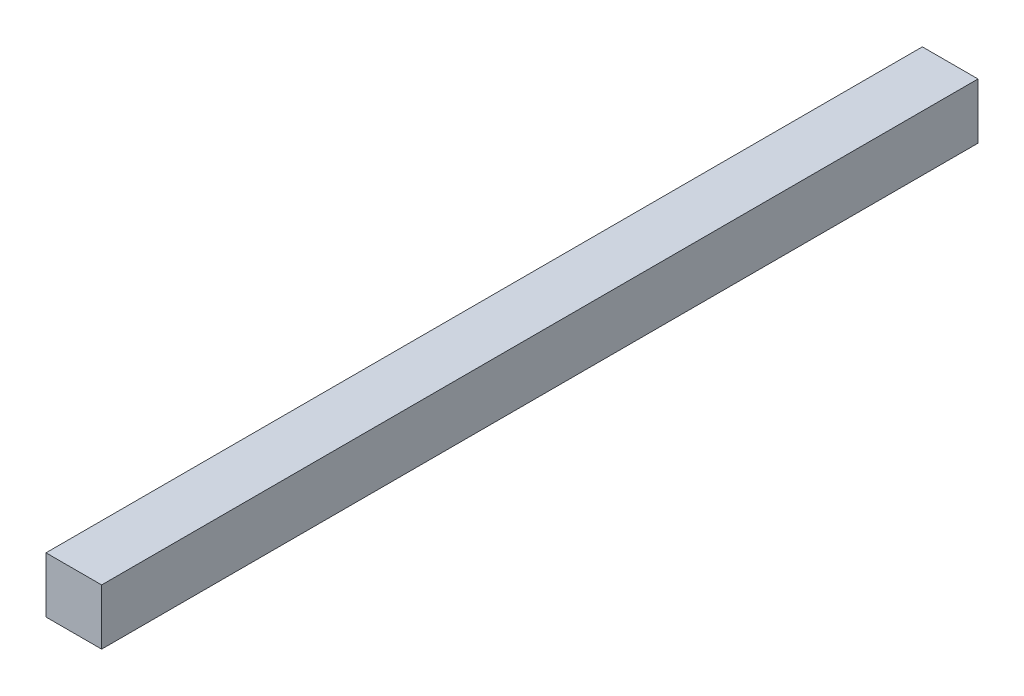
ISO-10303-21;
HEADER;
FILE_DESCRIPTION(('STEP AP214'),'2;1');
FILE_NAME('part.step','',(''),(''),'','','');
FILE_SCHEMA(('AUTOMOTIVE_DESIGN { 1 0 10303 214 1 1 1 1 }'));
ENDSEC;
DATA;
#1=APPLICATION_CONTEXT('core data for automotive mechanical design processes');
#2=APPLICATION_PROTOCOL_DEFINITION('international standard','automotive_design',2000,#1);
#3=PRODUCT_CONTEXT('',#1,'mechanical');
#4=PRODUCT('Part','Part','',(#3));
#5=PRODUCT_RELATED_PRODUCT_CATEGORY('part','',(#4));
#6=PRODUCT_DEFINITION_FORMATION('','',#4);
#7=PRODUCT_DEFINITION_CONTEXT('part definition',#1,'design');
#8=PRODUCT_DEFINITION('design','',#6,#7);
#9=PRODUCT_DEFINITION_SHAPE('','',#8);
#10=(LENGTH_UNIT() NAMED_UNIT(*) SI_UNIT(.MILLI.,.METRE.));
#11=(NAMED_UNIT(*) PLANE_ANGLE_UNIT() SI_UNIT($,.RADIAN.));
#12=(NAMED_UNIT(*) SI_UNIT($,.STERADIAN.) SOLID_ANGLE_UNIT());
#13=UNCERTAINTY_MEASURE_WITH_UNIT(LENGTH_MEASURE(1.E-05),#10,'distance_accuracy_value','');
#14=(GEOMETRIC_REPRESENTATION_CONTEXT(3) GLOBAL_UNCERTAINTY_ASSIGNED_CONTEXT((#13)) GLOBAL_UNIT_ASSIGNED_CONTEXT((#10,
#11,#12)) REPRESENTATION_CONTEXT('',''));
#15=CARTESIAN_POINT('',(0.,0.,0.));
#16=DIRECTION('',(0.,0.,1.));
#17=DIRECTION('',(1.,0.,0.));
#18=AXIS2_PLACEMENT_3D('',#15,#16,#17);
#19=CARTESIAN_POINT('',(0.,0.,-315.));
#20=DIRECTION('',(-1.,0.,0.));
#21=DIRECTION('',(0.,-1.,0.));
#22=AXIS2_PLACEMENT_3D('',#19,#20,#21);
#23=PLANE('',#22);
#24=DIRECTION('',(0.,-1.,0.));
#25=VECTOR('',#24,1.);
#26=CARTESIAN_POINT('',(0.,0.,0.));
#27=LINE('',#26,#25);
#28=CARTESIAN_POINT('',(0.,20.,0.));
#29=VERTEX_POINT('',#28);
#30=CARTESIAN_POINT('',(0.,0.,0.));
#31=VERTEX_POINT('',#30);
#32=EDGE_CURVE('E97',#29,#31,#27,.T.);
#33=ORIENTED_EDGE('',*,*,#32,.F.);
#34=DIRECTION('',(0.,0.,1.));
#35=VECTOR('',#34,1.);
#36=CARTESIAN_POINT('',(0.,20.,-315.));
#37=LINE('',#36,#35);
#38=CARTESIAN_POINT('',(0.,20.,-315.));
#39=VERTEX_POINT('',#38);
#40=EDGE_CURVE('E11',#39,#29,#37,.T.);
#41=ORIENTED_EDGE('',*,*,#40,.F.);
#42=DIRECTION('',(0.,-1.,0.));
#43=VECTOR('',#42,1.);
#44=CARTESIAN_POINT('',(0.,0.,-315.));
#45=LINE('',#44,#43);
#46=CARTESIAN_POINT('',(0.,0.,-315.));
#47=VERTEX_POINT('',#46);
#48=EDGE_CURVE('E91',#39,#47,#45,.T.);
#49=ORIENTED_EDGE('',*,*,#48,.T.);
#50=DIRECTION('',(0.,0.,1.));
#51=VECTOR('',#50,1.);
#52=CARTESIAN_POINT('',(0.,0.,-315.));
#53=LINE('',#52,#51);
#54=EDGE_CURVE('E36',#47,#31,#53,.T.);
#55=ORIENTED_EDGE('',*,*,#54,.T.);
#56=EDGE_LOOP('',(#33,#41,#49,#55));
#57=FACE_BOUND('',#56,.T.);
#58=ADVANCED_FACE('F33',(#57),#23,.T.);
#59=CARTESIAN_POINT('',(0.,20.,-315.));
#60=DIRECTION('',(0.,1.,0.));
#61=DIRECTION('',(0.,0.,1.));
#62=AXIS2_PLACEMENT_3D('',#59,#60,#61);
#63=PLANE('',#62);
#64=DIRECTION('',(-1.,0.,0.));
#65=VECTOR('',#64,1.);
#66=CARTESIAN_POINT('',(0.,20.,0.));
#67=LINE('',#66,#65);
#68=CARTESIAN_POINT('',(20.,20.,0.));
#69=VERTEX_POINT('',#68);
#70=EDGE_CURVE('E93',#69,#29,#67,.T.);
#71=ORIENTED_EDGE('',*,*,#70,.F.);
#72=DIRECTION('',(0.,0.,1.));
#73=VECTOR('',#72,1.);
#74=CARTESIAN_POINT('',(20.,20.,-315.));
#75=LINE('',#74,#73);
#76=CARTESIAN_POINT('',(20.,20.,-315.));
#77=VERTEX_POINT('',#76);
#78=EDGE_CURVE('E42',#77,#69,#75,.T.);
#79=ORIENTED_EDGE('',*,*,#78,.F.);
#80=DIRECTION('',(-1.,0.,0.));
#81=VECTOR('',#80,1.);
#82=CARTESIAN_POINT('',(0.,20.,-315.));
#83=LINE('',#82,#81);
#84=EDGE_CURVE('E88',#77,#39,#83,.T.);
#85=ORIENTED_EDGE('',*,*,#84,.T.);
#86=ORIENTED_EDGE('',*,*,#40,.T.);
#87=EDGE_LOOP('',(#71,#79,#85,#86));
#88=FACE_BOUND('',#87,.T.);
#89=ADVANCED_FACE('F107',(#88),#63,.T.);
#90=CARTESIAN_POINT('',(20.,0.,-315.));
#91=DIRECTION('',(1.,0.,0.));
#92=DIRECTION('',(0.,1.,0.));
#93=AXIS2_PLACEMENT_3D('',#90,#91,#92);
#94=PLANE('',#93);
#95=DIRECTION('',(0.,1.,0.));
#96=VECTOR('',#95,1.);
#97=CARTESIAN_POINT('',(20.,0.,0.));
#98=LINE('',#97,#96);
#99=CARTESIAN_POINT('',(20.,0.,0.));
#100=VERTEX_POINT('',#99);
#101=EDGE_CURVE('E83',#100,#69,#98,.T.);
#102=ORIENTED_EDGE('',*,*,#101,.F.);
#103=DIRECTION('',(0.,0.,1.));
#104=VECTOR('',#103,1.);
#105=CARTESIAN_POINT('',(20.,0.,-315.));
#106=LINE('',#105,#104);
#107=CARTESIAN_POINT('',(20.,0.,-315.));
#108=VERTEX_POINT('',#107);
#109=EDGE_CURVE('E78',#108,#100,#106,.T.);
#110=ORIENTED_EDGE('',*,*,#109,.F.);
#111=DIRECTION('',(0.,1.,0.));
#112=VECTOR('',#111,1.);
#113=CARTESIAN_POINT('',(20.,0.,-315.));
#114=LINE('',#113,#112);
#115=EDGE_CURVE('E81',#108,#77,#114,.T.);
#116=ORIENTED_EDGE('',*,*,#115,.T.);
#117=ORIENTED_EDGE('',*,*,#78,.T.);
#118=EDGE_LOOP('',(#102,#110,#116,#117));
#119=FACE_BOUND('',#118,.T.);
#120=ADVANCED_FACE('F80',(#119),#94,.T.);
#121=CARTESIAN_POINT('',(0.,0.,-315.));
#122=DIRECTION('',(0.,-1.,0.));
#123=DIRECTION('',(0.,0.,-1.));
#124=AXIS2_PLACEMENT_3D('',#121,#122,#123);
#125=PLANE('',#124);
#126=DIRECTION('',(1.,0.,0.));
#127=VECTOR('',#126,1.);
#128=CARTESIAN_POINT('',(0.,0.,0.));
#129=LINE('',#128,#127);
#130=EDGE_CURVE('E100',#31,#100,#129,.T.);
#131=ORIENTED_EDGE('',*,*,#130,.F.);
#132=ORIENTED_EDGE('',*,*,#54,.F.);
#133=DIRECTION('',(1.,0.,0.));
#134=VECTOR('',#133,1.);
#135=CARTESIAN_POINT('',(0.,0.,-315.));
#136=LINE('',#135,#134);
#137=EDGE_CURVE('E87',#47,#108,#136,.T.);
#138=ORIENTED_EDGE('',*,*,#137,.T.);
#139=ORIENTED_EDGE('',*,*,#109,.T.);
#140=EDGE_LOOP('',(#131,#132,#138,#139));
#141=FACE_BOUND('',#140,.T.);
#142=ADVANCED_FACE('F90',(#141),#125,.T.);
#143=CARTESIAN_POINT('',(0.,0.,-315.));
#144=DIRECTION('',(0.,0.,-1.));
#145=DIRECTION('',(-1.,0.,0.));
#146=AXIS2_PLACEMENT_3D('',#143,#144,#145);
#147=PLANE('',#146);
#148=ORIENTED_EDGE('',*,*,#48,.F.);
#149=ORIENTED_EDGE('',*,*,#84,.F.);
#150=ORIENTED_EDGE('',*,*,#115,.F.);
#151=ORIENTED_EDGE('',*,*,#137,.F.);
#152=EDGE_LOOP('',(#148,#149,#150,#151));
#153=FACE_BOUND('',#152,.T.);
#154=ADVANCED_FACE('F86',(#153),#147,.T.);
#155=CARTESIAN_POINT('',(0.,0.,0.));
#156=DIRECTION('',(0.,0.,-1.));
#157=DIRECTION('',(-1.,0.,0.));
#158=AXIS2_PLACEMENT_3D('',#155,#156,#157);
#159=PLANE('',#158);
#160=ORIENTED_EDGE('',*,*,#32,.T.);
#161=ORIENTED_EDGE('',*,*,#130,.T.);
#162=ORIENTED_EDGE('',*,*,#101,.T.);
#163=ORIENTED_EDGE('',*,*,#70,.T.);
#164=EDGE_LOOP('',(#160,#161,#162,#163));
#165=FACE_BOUND('',#164,.T.);
#166=ADVANCED_FACE('F106',(#165),#159,.F.);
#167=CLOSED_SHELL('',(#58,#89,#120,#142,#154,#166));
#168=MANIFOLD_SOLID_BREP('B2',#167);
#169=ADVANCED_BREP_SHAPE_REPRESENTATION('',(#18,#168),#14);
#170=SHAPE_DEFINITION_REPRESENTATION(#9,#169);
ENDSEC;
END-ISO-10303-21;
